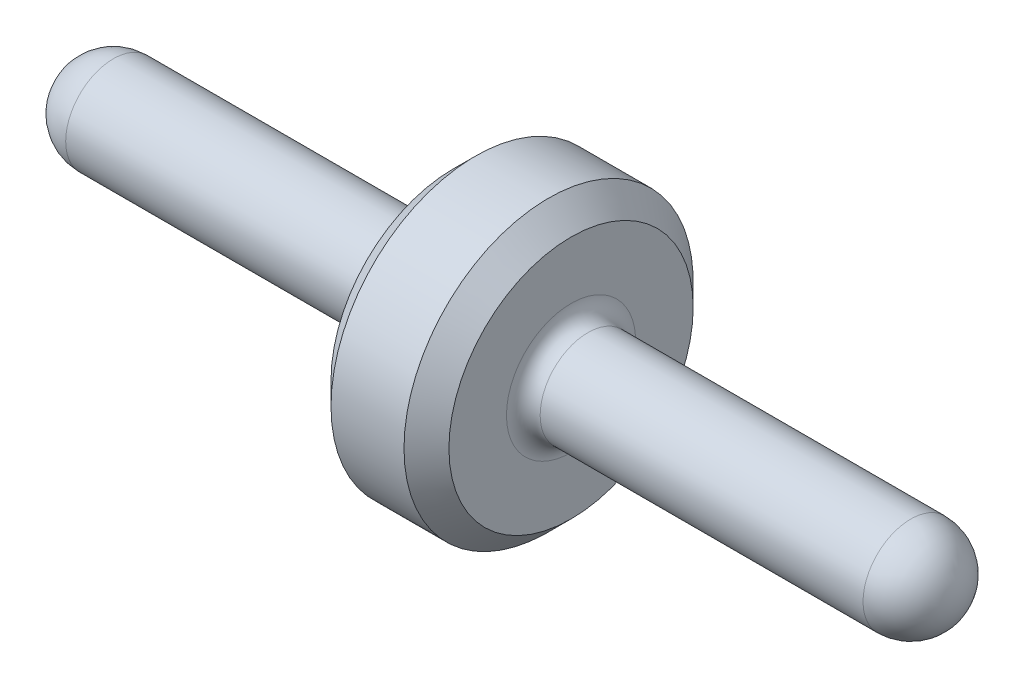
ISO-10303-21;
HEADER;
FILE_DESCRIPTION(('STEP AP214'),'2;1');
FILE_NAME('part.step','',(''),(''),'','','');
FILE_SCHEMA(('AUTOMOTIVE_DESIGN { 1 0 10303 214 1 1 1 1 }'));
ENDSEC;
DATA;
#1=APPLICATION_CONTEXT('core data for automotive mechanical design processes');
#2=APPLICATION_PROTOCOL_DEFINITION('international standard','automotive_design',2000,#1);
#3=PRODUCT_CONTEXT('',#1,'mechanical');
#4=PRODUCT('Part','Part','',(#3));
#5=PRODUCT_RELATED_PRODUCT_CATEGORY('part','',(#4));
#6=PRODUCT_DEFINITION_FORMATION('','',#4);
#7=PRODUCT_DEFINITION_CONTEXT('part definition',#1,'design');
#8=PRODUCT_DEFINITION('design','',#6,#7);
#9=PRODUCT_DEFINITION_SHAPE('','',#8);
#10=(LENGTH_UNIT() NAMED_UNIT(*) SI_UNIT(.MILLI.,.METRE.));
#11=(NAMED_UNIT(*) PLANE_ANGLE_UNIT() SI_UNIT($,.RADIAN.));
#12=(NAMED_UNIT(*) SI_UNIT($,.STERADIAN.) SOLID_ANGLE_UNIT());
#13=UNCERTAINTY_MEASURE_WITH_UNIT(LENGTH_MEASURE(1.E-05),#10,'distance_accuracy_value','');
#14=(GEOMETRIC_REPRESENTATION_CONTEXT(3) GLOBAL_UNCERTAINTY_ASSIGNED_CONTEXT((#13)) GLOBAL_UNIT_ASSIGNED_CONTEXT((#10,
#11,#12)) REPRESENTATION_CONTEXT('',''));
#15=CARTESIAN_POINT('',(0.,0.,0.));
#16=DIRECTION('',(0.,0.,1.));
#17=DIRECTION('',(1.,0.,0.));
#18=AXIS2_PLACEMENT_3D('',#15,#16,#17);
#19=CARTESIAN_POINT('',(1.8542,0.,0.));
#20=DIRECTION('',(1.,0.,0.));
#21=DIRECTION('',(0.,0.,-1.));
#22=AXIS2_PLACEMENT_3D('',#19,#20,#21);
#23=CONICAL_SURFACE('',#22,0.65405,0.785398163397);
#24=CARTESIAN_POINT('',(1.8542,0.,0.));
#25=DIRECTION('',(-1.,0.,0.));
#26=DIRECTION('',(0.,0.,1.));
#27=AXIS2_PLACEMENT_3D('',#24,#25,#26);
#28=CIRCLE('',#27,0.65405);
#29=CARTESIAN_POINT('',(1.8542,0.,0.65405));
#30=VERTEX_POINT('',#29);
#31=EDGE_CURVE('E10',#30,#30,#28,.T.);
#32=ORIENTED_EDGE('',*,*,#31,.T.);
#33=EDGE_LOOP('',(#32));
#34=FACE_BOUND('',#33,.T.);
#35=CARTESIAN_POINT('',(1.7526,0.,0.));
#36=DIRECTION('',(-1.,0.,0.));
#37=DIRECTION('',(0.,0.,1.));
#38=AXIS2_PLACEMENT_3D('',#35,#36,#37);
#39=CIRCLE('',#38,0.55245);
#40=CARTESIAN_POINT('',(1.7526,0.,0.55245));
#41=VERTEX_POINT('',#40);
#42=EDGE_CURVE('E31',#41,#41,#39,.T.);
#43=ORIENTED_EDGE('',*,*,#42,.F.);
#44=EDGE_LOOP('',(#43));
#45=FACE_BOUND('',#44,.T.);
#46=ADVANCED_FACE('F15',(#34,#45),#23,.T.);
#47=CARTESIAN_POINT('',(0.,0.,0.));
#48=DIRECTION('',(-1.,0.,0.));
#49=DIRECTION('',(0.,0.,1.));
#50=AXIS2_PLACEMENT_3D('',#47,#48,#49);
#51=CYLINDRICAL_SURFACE('',#50,0.65405);
#52=ORIENTED_EDGE('',*,*,#31,.F.);
#53=EDGE_LOOP('',(#52));
#54=FACE_BOUND('',#53,.T.);
#55=CARTESIAN_POINT('',(2.1844,0.,0.));
#56=DIRECTION('',(-1.,0.,0.));
#57=DIRECTION('',(0.,0.,1.));
#58=AXIS2_PLACEMENT_3D('',#55,#56,#57);
#59=CIRCLE('',#58,0.65405);
#60=CARTESIAN_POINT('',(2.1844,0.,0.65405));
#61=VERTEX_POINT('',#60);
#62=EDGE_CURVE('E23',#61,#61,#59,.T.);
#63=ORIENTED_EDGE('',*,*,#62,.T.);
#64=EDGE_LOOP('',(#63));
#65=FACE_BOUND('',#64,.T.);
#66=ADVANCED_FACE('F63',(#54,#65),#51,.T.);
#67=CARTESIAN_POINT('',(2.286,0.,0.));
#68=DIRECTION('',(-1.,0.,0.));
#69=DIRECTION('',(0.,0.,1.));
#70=AXIS2_PLACEMENT_3D('',#67,#68,#69);
#71=CONICAL_SURFACE('',#70,0.55245,0.785398163398);
#72=ORIENTED_EDGE('',*,*,#62,.F.);
#73=EDGE_LOOP('',(#72));
#74=FACE_BOUND('',#73,.T.);
#75=CARTESIAN_POINT('',(2.286,0.,0.));
#76=DIRECTION('',(-1.,0.,0.));
#77=DIRECTION('',(0.,0.,1.));
#78=AXIS2_PLACEMENT_3D('',#75,#76,#77);
#79=CIRCLE('',#78,0.55245);
#80=CARTESIAN_POINT('',(2.286,0.,0.55245));
#81=VERTEX_POINT('',#80);
#82=EDGE_CURVE('E28',#81,#81,#79,.T.);
#83=ORIENTED_EDGE('',*,*,#82,.T.);
#84=EDGE_LOOP('',(#83));
#85=FACE_BOUND('',#84,.T.);
#86=ADVANCED_FACE('F69',(#74,#85),#71,.T.);
#87=CARTESIAN_POINT('',(2.3622,0.,0.));
#88=DIRECTION('',(-1.,0.,0.));
#89=DIRECTION('',(0.,0.,1.));
#90=AXIS2_PLACEMENT_3D('',#87,#88,#89);
#91=TOROIDAL_SURFACE('',#90,0.2921,0.0762);
#92=CARTESIAN_POINT('',(2.3622,0.,0.));
#93=DIRECTION('',(-1.,0.,0.));
#94=DIRECTION('',(0.,0.,1.));
#95=AXIS2_PLACEMENT_3D('',#92,#93,#94);
#96=CIRCLE('',#95,0.2159);
#97=CARTESIAN_POINT('',(2.3622,0.,0.2159));
#98=VERTEX_POINT('',#97);
#99=EDGE_CURVE('E35',#98,#98,#96,.T.);
#100=ORIENTED_EDGE('',*,*,#99,.T.);
#101=EDGE_LOOP('',(#100));
#102=FACE_BOUND('',#101,.T.);
#103=CARTESIAN_POINT('',(2.286,0.,0.));
#104=DIRECTION('',(-1.,0.,0.));
#105=DIRECTION('',(0.,0.,1.));
#106=AXIS2_PLACEMENT_3D('',#103,#104,#105);
#107=CIRCLE('',#106,0.2921);
#108=CARTESIAN_POINT('',(2.286,0.,0.2921));
#109=VERTEX_POINT('',#108);
#110=EDGE_CURVE('E36',#109,#109,#107,.T.);
#111=ORIENTED_EDGE('',*,*,#110,.F.);
#112=EDGE_LOOP('',(#111));
#113=FACE_BOUND('',#112,.T.);
#114=ADVANCED_FACE('F75',(#102,#113),#91,.F.);
#115=CARTESIAN_POINT('',(0.,0.,0.));
#116=DIRECTION('',(-1.,0.,0.));
#117=DIRECTION('',(0.,0.,1.));
#118=AXIS2_PLACEMENT_3D('',#115,#116,#117);
#119=CYLINDRICAL_SURFACE('',#118,0.2159);
#120=ORIENTED_EDGE('',*,*,#99,.F.);
#121=EDGE_LOOP('',(#120));
#122=FACE_BOUND('',#121,.T.);
#123=CARTESIAN_POINT('',(3.8227,0.,0.));
#124=DIRECTION('',(-1.,0.,0.));
#125=DIRECTION('',(0.,0.,1.));
#126=AXIS2_PLACEMENT_3D('',#123,#124,#125);
#127=CIRCLE('',#126,0.2159);
#128=CARTESIAN_POINT('',(3.8227,0.,0.2159));
#129=VERTEX_POINT('',#128);
#130=EDGE_CURVE('E41',#129,#129,#127,.T.);
#131=ORIENTED_EDGE('',*,*,#130,.T.);
#132=EDGE_LOOP('',(#131));
#133=FACE_BOUND('',#132,.T.);
#134=ADVANCED_FACE('F79',(#122,#133),#119,.T.);
#135=CARTESIAN_POINT('',(3.8227,0.,0.));
#136=DIRECTION('',(0.,0.,-1.));
#137=DIRECTION('',(0.,1.,0.));
#138=AXIS2_PLACEMENT_3D('',#135,#136,#137);
#139=SPHERICAL_SURFACE('',#138,0.2159);
#140=CARTESIAN_POINT('',(3.8227,0.,0.));
#141=DIRECTION('',(-1.,0.,0.));
#142=DIRECTION('',(0.,0.,1.));
#143=AXIS2_PLACEMENT_3D('',#140,#141,#142);
#144=SPHERICAL_SURFACE('',#143,0.2159);
#145=ORIENTED_EDGE('',*,*,#130,.F.);
#146=EDGE_LOOP('',(#145));
#147=FACE_BOUND('',#146,.T.);
#148=ADVANCED_FACE('F83',(#147),#144,.T.);
#149=CARTESIAN_POINT('',(0.2159,0.,0.));
#150=DIRECTION('',(0.,0.,-1.));
#151=DIRECTION('',(0.,1.,0.));
#152=AXIS2_PLACEMENT_3D('',#149,#150,#151);
#153=SPHERICAL_SURFACE('',#152,0.2159);
#154=CARTESIAN_POINT('',(0.2159,0.,0.));
#155=DIRECTION('',(-1.,0.,0.));
#156=DIRECTION('',(0.,0.,1.));
#157=AXIS2_PLACEMENT_3D('',#154,#155,#156);
#158=SPHERICAL_SURFACE('',#157,0.2159);
#159=CARTESIAN_POINT('',(0.2159,0.,0.));
#160=DIRECTION('',(-1.,0.,0.));
#161=DIRECTION('',(0.,0.,1.));
#162=AXIS2_PLACEMENT_3D('',#159,#160,#161);
#163=CIRCLE('',#162,0.2159);
#164=CARTESIAN_POINT('',(0.2159,0.,0.2159));
#165=VERTEX_POINT('',#164);
#166=EDGE_CURVE('E44',#165,#165,#163,.T.);
#167=ORIENTED_EDGE('',*,*,#166,.T.);
#168=EDGE_LOOP('',(#167));
#169=FACE_BOUND('',#168,.T.);
#170=ADVANCED_FACE('F87',(#169),#158,.T.);
#171=CARTESIAN_POINT('',(0.,0.,0.));
#172=DIRECTION('',(-1.,0.,0.));
#173=DIRECTION('',(0.,0.,1.));
#174=AXIS2_PLACEMENT_3D('',#171,#172,#173);
#175=CYLINDRICAL_SURFACE('',#174,0.2159);
#176=ORIENTED_EDGE('',*,*,#166,.F.);
#177=EDGE_LOOP('',(#176));
#178=FACE_BOUND('',#177,.T.);
#179=CARTESIAN_POINT('',(1.6764,0.,0.));
#180=DIRECTION('',(-1.,0.,0.));
#181=DIRECTION('',(0.,0.,1.));
#182=AXIS2_PLACEMENT_3D('',#179,#180,#181);
#183=CIRCLE('',#182,0.2159);
#184=CARTESIAN_POINT('',(1.6764,0.,0.2159));
#185=VERTEX_POINT('',#184);
#186=EDGE_CURVE('E46',#185,#185,#183,.T.);
#187=ORIENTED_EDGE('',*,*,#186,.T.);
#188=EDGE_LOOP('',(#187));
#189=FACE_BOUND('',#188,.T.);
#190=ADVANCED_FACE('F91',(#178,#189),#175,.T.);
#191=CARTESIAN_POINT('',(1.6764,0.,0.));
#192=DIRECTION('',(-1.,0.,0.));
#193=DIRECTION('',(0.,0.,1.));
#194=AXIS2_PLACEMENT_3D('',#191,#192,#193);
#195=TOROIDAL_SURFACE('',#194,0.2921,0.0762);
#196=CARTESIAN_POINT('',(1.7526,0.,0.));
#197=DIRECTION('',(-1.,0.,0.));
#198=DIRECTION('',(0.,0.,1.));
#199=AXIS2_PLACEMENT_3D('',#196,#197,#198);
#200=CIRCLE('',#199,0.2921);
#201=CARTESIAN_POINT('',(1.7526,0.,0.2921));
#202=VERTEX_POINT('',#201);
#203=EDGE_CURVE('E19',#202,#202,#200,.T.);
#204=ORIENTED_EDGE('',*,*,#203,.T.);
#205=EDGE_LOOP('',(#204));
#206=FACE_BOUND('',#205,.T.);
#207=ORIENTED_EDGE('',*,*,#186,.F.);
#208=EDGE_LOOP('',(#207));
#209=FACE_BOUND('',#208,.T.);
#210=ADVANCED_FACE('F53',(#206,#209),#195,.F.);
#211=CARTESIAN_POINT('',(2.286,0.2921,0.));
#212=DIRECTION('',(-1.,0.,0.));
#213=DIRECTION('',(0.,0.,1.));
#214=AXIS2_PLACEMENT_3D('',#211,#212,#213);
#215=PLANE('',#214);
#216=ORIENTED_EDGE('',*,*,#82,.F.);
#217=EDGE_LOOP('',(#216));
#218=FACE_BOUND('',#217,.T.);
#219=ORIENTED_EDGE('',*,*,#110,.T.);
#220=EDGE_LOOP('',(#219));
#221=FACE_BOUND('',#220,.T.);
#222=ADVANCED_FACE('F58',(#218,#221),#215,.F.);
#223=CARTESIAN_POINT('',(1.7526,0.2921,0.));
#224=DIRECTION('',(1.,0.,0.));
#225=DIRECTION('',(0.,0.,-1.));
#226=AXIS2_PLACEMENT_3D('',#223,#224,#225);
#227=PLANE('',#226);
#228=ORIENTED_EDGE('',*,*,#203,.F.);
#229=EDGE_LOOP('',(#228));
#230=FACE_BOUND('',#229,.T.);
#231=ORIENTED_EDGE('',*,*,#42,.T.);
#232=EDGE_LOOP('',(#231));
#233=FACE_BOUND('',#232,.T.);
#234=ADVANCED_FACE('F17',(#230,#233),#227,.F.);
#235=CLOSED_SHELL('',(#46,#66,#86,#114,#134,#148,#170,#190,#210,#222,#234));
#236=MANIFOLD_SOLID_BREP('B1',#235);
#237=ADVANCED_BREP_SHAPE_REPRESENTATION('',(#18,#236),#14);
#238=SHAPE_DEFINITION_REPRESENTATION(#9,#237);
ENDSEC;
END-ISO-10303-21;
